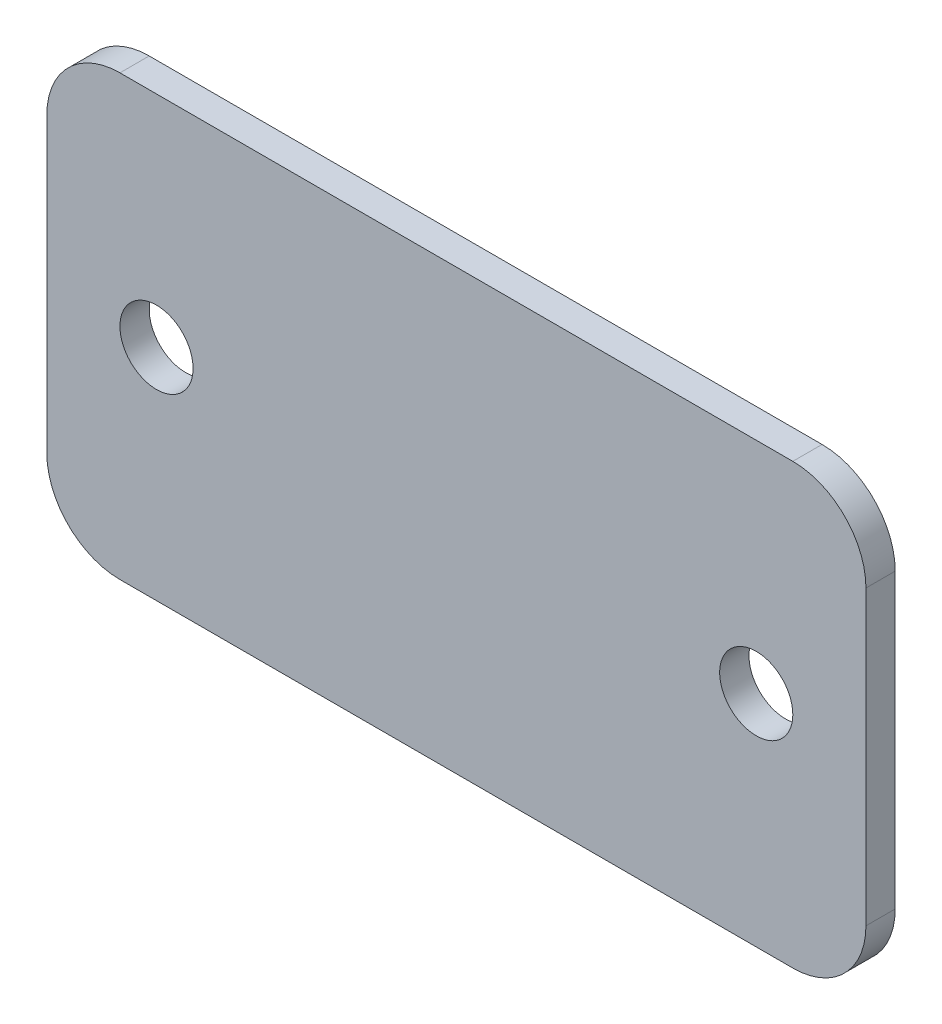
ISO-10303-21;
HEADER;
FILE_DESCRIPTION(('STEP AP214'),'2;1');
FILE_NAME('part.step','',(''),(''),'','','');
FILE_SCHEMA(('AUTOMOTIVE_DESIGN { 1 0 10303 214 1 1 1 1 }'));
ENDSEC;
DATA;
#1=APPLICATION_CONTEXT('core data for automotive mechanical design processes');
#2=APPLICATION_PROTOCOL_DEFINITION('international standard','automotive_design',2000,#1);
#3=PRODUCT_CONTEXT('',#1,'mechanical');
#4=PRODUCT('Part','Part','',(#3));
#5=PRODUCT_RELATED_PRODUCT_CATEGORY('part','',(#4));
#6=PRODUCT_DEFINITION_FORMATION('','',#4);
#7=PRODUCT_DEFINITION_CONTEXT('part definition',#1,'design');
#8=PRODUCT_DEFINITION('design','',#6,#7);
#9=PRODUCT_DEFINITION_SHAPE('','',#8);
#10=(LENGTH_UNIT() NAMED_UNIT(*) SI_UNIT(.MILLI.,.METRE.));
#11=(NAMED_UNIT(*) PLANE_ANGLE_UNIT() SI_UNIT($,.RADIAN.));
#12=(NAMED_UNIT(*) SI_UNIT($,.STERADIAN.) SOLID_ANGLE_UNIT());
#13=UNCERTAINTY_MEASURE_WITH_UNIT(LENGTH_MEASURE(1.E-05),#10,'distance_accuracy_value','');
#14=(GEOMETRIC_REPRESENTATION_CONTEXT(3) GLOBAL_UNCERTAINTY_ASSIGNED_CONTEXT((#13)) GLOBAL_UNIT_ASSIGNED_CONTEXT((#10,
#11,#12)) REPRESENTATION_CONTEXT('',''));
#15=CARTESIAN_POINT('',(0.,0.,0.));
#16=DIRECTION('',(0.,0.,1.));
#17=DIRECTION('',(1.,0.,0.));
#18=AXIS2_PLACEMENT_3D('',#15,#16,#17);
#19=CARTESIAN_POINT('',(-46.,-20.,4.));
#20=DIRECTION('',(0.,0.,-1.));
#21=DIRECTION('',(-1.,0.,0.));
#22=AXIS2_PLACEMENT_3D('',#19,#20,#21);
#23=PLANE('',#22);
#24=CARTESIAN_POINT('',(-46.,-20.,4.));
#25=DIRECTION('',(0.,0.,1.));
#26=DIRECTION('',(-1.,0.,0.));
#27=AXIS2_PLACEMENT_3D('',#24,#25,#26);
#28=CIRCLE('',#27,10.);
#29=CARTESIAN_POINT('',(-56.,-19.9999999999999,4.));
#30=VERTEX_POINT('',#29);
#31=CARTESIAN_POINT('',(-45.9999999999999,-30.,4.));
#32=VERTEX_POINT('',#31);
#33=EDGE_CURVE('E156',#30,#32,#28,.T.);
#34=ORIENTED_EDGE('',*,*,#33,.T.);
#35=DIRECTION('',(1.,0.,0.));
#36=VECTOR('',#35,1.);
#37=CARTESIAN_POINT('',(45.9999999999999,-30.,4.));
#38=LINE('',#37,#36);
#39=CARTESIAN_POINT('',(45.9999999999999,-30.,4.));
#40=VERTEX_POINT('',#39);
#41=EDGE_CURVE('E96',#32,#40,#38,.T.);
#42=ORIENTED_EDGE('',*,*,#41,.T.);
#43=CARTESIAN_POINT('',(46.,-20.,4.));
#44=DIRECTION('',(0.,0.,1.));
#45=DIRECTION('',(1.,0.,0.));
#46=AXIS2_PLACEMENT_3D('',#43,#44,#45);
#47=CIRCLE('',#46,10.);
#48=CARTESIAN_POINT('',(56.,-20.,4.));
#49=VERTEX_POINT('',#48);
#50=EDGE_CURVE('E167',#40,#49,#47,.T.);
#51=ORIENTED_EDGE('',*,*,#50,.T.);
#52=DIRECTION('',(0.,1.,0.));
#53=VECTOR('',#52,1.);
#54=CARTESIAN_POINT('',(56.,-19.9999999999999,4.));
#55=LINE('',#54,#53);
#56=CARTESIAN_POINT('',(56.,19.9999999999999,4.));
#57=VERTEX_POINT('',#56);
#58=EDGE_CURVE('E170',#49,#57,#55,.T.);
#59=ORIENTED_EDGE('',*,*,#58,.T.);
#60=CARTESIAN_POINT('',(46.,20.,4.));
#61=DIRECTION('',(0.,0.,1.));
#62=DIRECTION('',(1.,0.,0.));
#63=AXIS2_PLACEMENT_3D('',#60,#61,#62);
#64=CIRCLE('',#63,10.);
#65=CARTESIAN_POINT('',(45.9999999999999,30.,4.));
#66=VERTEX_POINT('',#65);
#67=EDGE_CURVE('E115',#57,#66,#64,.T.);
#68=ORIENTED_EDGE('',*,*,#67,.T.);
#69=DIRECTION('',(-1.,0.,0.));
#70=VECTOR('',#69,1.);
#71=CARTESIAN_POINT('',(45.9999999999999,30.,4.));
#72=LINE('',#71,#70);
#73=CARTESIAN_POINT('',(-45.9999999999999,30.,4.));
#74=VERTEX_POINT('',#73);
#75=EDGE_CURVE('E109',#66,#74,#72,.T.);
#76=ORIENTED_EDGE('',*,*,#75,.T.);
#77=CARTESIAN_POINT('',(-46.,20.,4.));
#78=DIRECTION('',(0.,0.,1.));
#79=DIRECTION('',(1.,0.,0.));
#80=AXIS2_PLACEMENT_3D('',#77,#78,#79);
#81=CIRCLE('',#80,10.);
#82=CARTESIAN_POINT('',(-56.,19.9999999999999,4.));
#83=VERTEX_POINT('',#82);
#84=EDGE_CURVE('E113',#74,#83,#81,.T.);
#85=ORIENTED_EDGE('',*,*,#84,.T.);
#86=DIRECTION('',(0.,-1.,0.));
#87=VECTOR('',#86,1.);
#88=CARTESIAN_POINT('',(-56.,-19.9999999999999,4.));
#89=LINE('',#88,#87);
#90=EDGE_CURVE('E53',#83,#30,#89,.T.);
#91=ORIENTED_EDGE('',*,*,#90,.T.);
#92=EDGE_LOOP('',(#34,#42,#51,#59,#68,#76,#85,#91));
#93=FACE_BOUND('',#92,.T.);
#94=CARTESIAN_POINT('',(-41.,0.,4.));
#95=DIRECTION('',(0.,0.,1.));
#96=DIRECTION('',(1.,0.,0.));
#97=AXIS2_PLACEMENT_3D('',#94,#95,#96);
#98=CIRCLE('',#97,5.);
#99=CARTESIAN_POINT('',(-36.,0.,4.));
#100=VERTEX_POINT('',#99);
#101=EDGE_CURVE('E144',#100,#100,#98,.T.);
#102=ORIENTED_EDGE('',*,*,#101,.F.);
#103=EDGE_LOOP('',(#102));
#104=FACE_BOUND('',#103,.T.);
#105=CARTESIAN_POINT('',(41.,0.,4.));
#106=DIRECTION('',(0.,0.,1.));
#107=DIRECTION('',(1.,0.,0.));
#108=AXIS2_PLACEMENT_3D('',#105,#106,#107);
#109=CIRCLE('',#108,5.);
#110=CARTESIAN_POINT('',(46.,0.,4.));
#111=VERTEX_POINT('',#110);
#112=EDGE_CURVE('E155',#111,#111,#109,.T.);
#113=ORIENTED_EDGE('',*,*,#112,.F.);
#114=EDGE_LOOP('',(#113));
#115=FACE_BOUND('',#114,.T.);
#116=ADVANCED_FACE('F36',(#93,#104,#115),#23,.F.);
#117=CARTESIAN_POINT('',(-46.,-20.,0.));
#118=DIRECTION('',(0.,0.,-1.));
#119=DIRECTION('',(-1.,0.,0.));
#120=AXIS2_PLACEMENT_3D('',#117,#118,#119);
#121=PLANE('',#120);
#122=CARTESIAN_POINT('',(-41.,0.,0.));
#123=DIRECTION('',(0.,0.,1.));
#124=DIRECTION('',(1.,0.,0.));
#125=AXIS2_PLACEMENT_3D('',#122,#123,#124);
#126=CIRCLE('',#125,5.);
#127=CARTESIAN_POINT('',(-36.,0.,0.));
#128=VERTEX_POINT('',#127);
#129=EDGE_CURVE('E151',#128,#128,#126,.T.);
#130=ORIENTED_EDGE('',*,*,#129,.T.);
#131=EDGE_LOOP('',(#130));
#132=FACE_BOUND('',#131,.T.);
#133=CARTESIAN_POINT('',(-46.,-20.,0.));
#134=DIRECTION('',(0.,0.,1.));
#135=DIRECTION('',(-1.,0.,0.));
#136=AXIS2_PLACEMENT_3D('',#133,#134,#135);
#137=CIRCLE('',#136,10.);
#138=CARTESIAN_POINT('',(-56.,-19.9999999999999,0.));
#139=VERTEX_POINT('',#138);
#140=CARTESIAN_POINT('',(-45.9999999999999,-30.,0.));
#141=VERTEX_POINT('',#140);
#142=EDGE_CURVE('E150',#139,#141,#137,.T.);
#143=ORIENTED_EDGE('',*,*,#142,.F.);
#144=DIRECTION('',(0.,-1.,0.));
#145=VECTOR('',#144,1.);
#146=CARTESIAN_POINT('',(-56.,-19.9999999999999,0.));
#147=LINE('',#146,#145);
#148=CARTESIAN_POINT('',(-56.,19.9999999999999,0.));
#149=VERTEX_POINT('',#148);
#150=EDGE_CURVE('E88',#149,#139,#147,.T.);
#151=ORIENTED_EDGE('',*,*,#150,.F.);
#152=CARTESIAN_POINT('',(-46.,20.,0.));
#153=DIRECTION('',(0.,0.,1.));
#154=DIRECTION('',(1.,0.,0.));
#155=AXIS2_PLACEMENT_3D('',#152,#153,#154);
#156=CIRCLE('',#155,10.);
#157=CARTESIAN_POINT('',(-45.9999999999999,30.,0.));
#158=VERTEX_POINT('',#157);
#159=EDGE_CURVE('E82',#158,#149,#156,.T.);
#160=ORIENTED_EDGE('',*,*,#159,.F.);
#161=DIRECTION('',(-1.,0.,0.));
#162=VECTOR('',#161,1.);
#163=CARTESIAN_POINT('',(45.9999999999999,30.,0.));
#164=LINE('',#163,#162);
#165=CARTESIAN_POINT('',(45.9999999999999,30.,0.));
#166=VERTEX_POINT('',#165);
#167=EDGE_CURVE('E124',#166,#158,#164,.T.);
#168=ORIENTED_EDGE('',*,*,#167,.F.);
#169=CARTESIAN_POINT('',(46.,20.,0.));
#170=DIRECTION('',(0.,0.,1.));
#171=DIRECTION('',(1.,0.,0.));
#172=AXIS2_PLACEMENT_3D('',#169,#170,#171);
#173=CIRCLE('',#172,10.);
#174=CARTESIAN_POINT('',(56.,19.9999999999999,0.));
#175=VERTEX_POINT('',#174);
#176=EDGE_CURVE('E202',#175,#166,#173,.T.);
#177=ORIENTED_EDGE('',*,*,#176,.F.);
#178=DIRECTION('',(0.,1.,0.));
#179=VECTOR('',#178,1.);
#180=CARTESIAN_POINT('',(56.,-19.9999999999999,0.));
#181=LINE('',#180,#179);
#182=CARTESIAN_POINT('',(56.,-20.,0.));
#183=VERTEX_POINT('',#182);
#184=EDGE_CURVE('E197',#183,#175,#181,.T.);
#185=ORIENTED_EDGE('',*,*,#184,.F.);
#186=CARTESIAN_POINT('',(46.,-20.,0.));
#187=DIRECTION('',(0.,0.,1.));
#188=DIRECTION('',(1.,0.,0.));
#189=AXIS2_PLACEMENT_3D('',#186,#187,#188);
#190=CIRCLE('',#189,10.);
#191=CARTESIAN_POINT('',(45.9999999999999,-30.,0.));
#192=VERTEX_POINT('',#191);
#193=EDGE_CURVE('E189',#192,#183,#190,.T.);
#194=ORIENTED_EDGE('',*,*,#193,.F.);
#195=DIRECTION('',(1.,0.,0.));
#196=VECTOR('',#195,1.);
#197=CARTESIAN_POINT('',(45.9999999999999,-30.,0.));
#198=LINE('',#197,#196);
#199=EDGE_CURVE('E182',#141,#192,#198,.T.);
#200=ORIENTED_EDGE('',*,*,#199,.F.);
#201=EDGE_LOOP('',(#143,#151,#160,#168,#177,#185,#194,#200));
#202=FACE_BOUND('',#201,.T.);
#203=CARTESIAN_POINT('',(41.,0.,0.));
#204=DIRECTION('',(0.,0.,1.));
#205=DIRECTION('',(1.,0.,0.));
#206=AXIS2_PLACEMENT_3D('',#203,#204,#205);
#207=CIRCLE('',#206,5.);
#208=CARTESIAN_POINT('',(46.,0.,0.));
#209=VERTEX_POINT('',#208);
#210=EDGE_CURVE('E152',#209,#209,#207,.T.);
#211=ORIENTED_EDGE('',*,*,#210,.T.);
#212=EDGE_LOOP('',(#211));
#213=FACE_BOUND('',#212,.T.);
#214=ADVANCED_FACE('F217',(#132,#202,#213),#121,.T.);
#215=CARTESIAN_POINT('',(-46.,-20.,4.));
#216=DIRECTION('',(0.,0.,-1.));
#217=DIRECTION('',(-1.,0.,0.));
#218=AXIS2_PLACEMENT_3D('',#215,#216,#217);
#219=CYLINDRICAL_SURFACE('',#218,10.);
#220=ORIENTED_EDGE('',*,*,#142,.T.);
#221=DIRECTION('',(0.,0.,-1.));
#222=VECTOR('',#221,1.);
#223=CARTESIAN_POINT('',(-45.9999999999999,-30.,4.));
#224=LINE('',#223,#222);
#225=EDGE_CURVE('E12',#32,#141,#224,.T.);
#226=ORIENTED_EDGE('',*,*,#225,.F.);
#227=ORIENTED_EDGE('',*,*,#33,.F.);
#228=DIRECTION('',(0.,0.,-1.));
#229=VECTOR('',#228,1.);
#230=CARTESIAN_POINT('',(-56.,-19.9999999999999,4.));
#231=LINE('',#230,#229);
#232=EDGE_CURVE('E132',#30,#139,#231,.T.);
#233=ORIENTED_EDGE('',*,*,#232,.T.);
#234=EDGE_LOOP('',(#220,#226,#227,#233));
#235=FACE_BOUND('',#234,.T.);
#236=ADVANCED_FACE('F38',(#235),#219,.T.);
#237=CARTESIAN_POINT('',(45.9999999999999,-30.,4.));
#238=DIRECTION('',(0.,1.,0.));
#239=DIRECTION('',(-1.,0.,0.));
#240=AXIS2_PLACEMENT_3D('',#237,#238,#239);
#241=PLANE('',#240);
#242=ORIENTED_EDGE('',*,*,#199,.T.);
#243=DIRECTION('',(0.,0.,-1.));
#244=VECTOR('',#243,1.);
#245=CARTESIAN_POINT('',(45.9999999999999,-30.,4.));
#246=LINE('',#245,#244);
#247=EDGE_CURVE('E45',#40,#192,#246,.T.);
#248=ORIENTED_EDGE('',*,*,#247,.F.);
#249=ORIENTED_EDGE('',*,*,#41,.F.);
#250=ORIENTED_EDGE('',*,*,#225,.T.);
#251=EDGE_LOOP('',(#242,#248,#249,#250));
#252=FACE_BOUND('',#251,.T.);
#253=ADVANCED_FACE('F181',(#252),#241,.F.);
#254=CARTESIAN_POINT('',(46.,-20.,4.));
#255=DIRECTION('',(0.,0.,-1.));
#256=DIRECTION('',(-1.,0.,0.));
#257=AXIS2_PLACEMENT_3D('',#254,#255,#256);
#258=CYLINDRICAL_SURFACE('',#257,10.);
#259=ORIENTED_EDGE('',*,*,#193,.T.);
#260=DIRECTION('',(0.,0.,-1.));
#261=VECTOR('',#260,1.);
#262=CARTESIAN_POINT('',(56.,-20.,4.));
#263=LINE('',#262,#261);
#264=EDGE_CURVE('E185',#49,#183,#263,.T.);
#265=ORIENTED_EDGE('',*,*,#264,.F.);
#266=ORIENTED_EDGE('',*,*,#50,.F.);
#267=ORIENTED_EDGE('',*,*,#247,.T.);
#268=EDGE_LOOP('',(#259,#265,#266,#267));
#269=FACE_BOUND('',#268,.T.);
#270=ADVANCED_FACE('F186',(#269),#258,.T.);
#271=CARTESIAN_POINT('',(56.,-19.9999999999999,4.));
#272=DIRECTION('',(-1.,0.,0.));
#273=DIRECTION('',(0.,-1.,0.));
#274=AXIS2_PLACEMENT_3D('',#271,#272,#273);
#275=PLANE('',#274);
#276=ORIENTED_EDGE('',*,*,#184,.T.);
#277=DIRECTION('',(0.,0.,-1.));
#278=VECTOR('',#277,1.);
#279=CARTESIAN_POINT('',(56.,19.9999999999999,4.));
#280=LINE('',#279,#278);
#281=EDGE_CURVE('E192',#57,#175,#280,.T.);
#282=ORIENTED_EDGE('',*,*,#281,.F.);
#283=ORIENTED_EDGE('',*,*,#58,.F.);
#284=ORIENTED_EDGE('',*,*,#264,.T.);
#285=EDGE_LOOP('',(#276,#282,#283,#284));
#286=FACE_BOUND('',#285,.T.);
#287=ADVANCED_FACE('F195',(#286),#275,.F.);
#288=CARTESIAN_POINT('',(46.,20.,4.));
#289=DIRECTION('',(0.,0.,-1.));
#290=DIRECTION('',(-1.,0.,0.));
#291=AXIS2_PLACEMENT_3D('',#288,#289,#290);
#292=CYLINDRICAL_SURFACE('',#291,10.);
#293=ORIENTED_EDGE('',*,*,#176,.T.);
#294=DIRECTION('',(0.,0.,-1.));
#295=VECTOR('',#294,1.);
#296=CARTESIAN_POINT('',(45.9999999999999,30.,4.));
#297=LINE('',#296,#295);
#298=EDGE_CURVE('E125',#66,#166,#297,.T.);
#299=ORIENTED_EDGE('',*,*,#298,.F.);
#300=ORIENTED_EDGE('',*,*,#67,.F.);
#301=ORIENTED_EDGE('',*,*,#281,.T.);
#302=EDGE_LOOP('',(#293,#299,#300,#301));
#303=FACE_BOUND('',#302,.T.);
#304=ADVANCED_FACE('F201',(#303),#292,.T.);
#305=CARTESIAN_POINT('',(45.9999999999999,30.,4.));
#306=DIRECTION('',(0.,-1.,0.));
#307=DIRECTION('',(1.,0.,0.));
#308=AXIS2_PLACEMENT_3D('',#305,#306,#307);
#309=PLANE('',#308);
#310=ORIENTED_EDGE('',*,*,#167,.T.);
#311=DIRECTION('',(0.,0.,-1.));
#312=VECTOR('',#311,1.);
#313=CARTESIAN_POINT('',(-45.9999999999999,30.,4.));
#314=LINE('',#313,#312);
#315=EDGE_CURVE('E121',#74,#158,#314,.T.);
#316=ORIENTED_EDGE('',*,*,#315,.F.);
#317=ORIENTED_EDGE('',*,*,#75,.F.);
#318=ORIENTED_EDGE('',*,*,#298,.T.);
#319=EDGE_LOOP('',(#310,#316,#317,#318));
#320=FACE_BOUND('',#319,.T.);
#321=ADVANCED_FACE('F122',(#320),#309,.F.);
#322=CARTESIAN_POINT('',(-46.,20.,4.));
#323=DIRECTION('',(0.,0.,-1.));
#324=DIRECTION('',(-1.,0.,0.));
#325=AXIS2_PLACEMENT_3D('',#322,#323,#324);
#326=CYLINDRICAL_SURFACE('',#325,10.);
#327=ORIENTED_EDGE('',*,*,#159,.T.);
#328=DIRECTION('',(0.,0.,-1.));
#329=VECTOR('',#328,1.);
#330=CARTESIAN_POINT('',(-56.,19.9999999999999,4.));
#331=LINE('',#330,#329);
#332=EDGE_CURVE('E126',#83,#149,#331,.T.);
#333=ORIENTED_EDGE('',*,*,#332,.F.);
#334=ORIENTED_EDGE('',*,*,#84,.F.);
#335=ORIENTED_EDGE('',*,*,#315,.T.);
#336=EDGE_LOOP('',(#327,#333,#334,#335));
#337=FACE_BOUND('',#336,.T.);
#338=ADVANCED_FACE('F128',(#337),#326,.T.);
#339=CARTESIAN_POINT('',(-56.,-19.9999999999999,4.));
#340=DIRECTION('',(1.,0.,0.));
#341=DIRECTION('',(0.,0.,-1.));
#342=AXIS2_PLACEMENT_3D('',#339,#340,#341);
#343=PLANE('',#342);
#344=ORIENTED_EDGE('',*,*,#150,.T.);
#345=ORIENTED_EDGE('',*,*,#232,.F.);
#346=ORIENTED_EDGE('',*,*,#90,.F.);
#347=ORIENTED_EDGE('',*,*,#332,.T.);
#348=EDGE_LOOP('',(#344,#345,#346,#347));
#349=FACE_BOUND('',#348,.T.);
#350=ADVANCED_FACE('F240',(#349),#343,.F.);
#351=CARTESIAN_POINT('',(-41.,0.,4.));
#352=DIRECTION('',(0.,0.,-1.));
#353=DIRECTION('',(-1.,0.,0.));
#354=AXIS2_PLACEMENT_3D('',#351,#352,#353);
#355=CYLINDRICAL_SURFACE('',#354,5.);
#356=ORIENTED_EDGE('',*,*,#101,.T.);
#357=EDGE_LOOP('',(#356));
#358=FACE_BOUND('',#357,.T.);
#359=ORIENTED_EDGE('',*,*,#129,.F.);
#360=EDGE_LOOP('',(#359));
#361=FACE_BOUND('',#360,.T.);
#362=ADVANCED_FACE('F237',(#358,#361),#355,.F.);
#363=CARTESIAN_POINT('',(41.,0.,4.));
#364=DIRECTION('',(0.,0.,-1.));
#365=DIRECTION('',(-1.,0.,0.));
#366=AXIS2_PLACEMENT_3D('',#363,#364,#365);
#367=CYLINDRICAL_SURFACE('',#366,5.);
#368=ORIENTED_EDGE('',*,*,#112,.T.);
#369=EDGE_LOOP('',(#368));
#370=FACE_BOUND('',#369,.T.);
#371=ORIENTED_EDGE('',*,*,#210,.F.);
#372=EDGE_LOOP('',(#371));
#373=FACE_BOUND('',#372,.T.);
#374=ADVANCED_FACE('F230',(#370,#373),#367,.F.);
#375=CLOSED_SHELL('',(#116,#214,#236,#253,#270,#287,#304,#321,#338,#350,#362,#374));
#376=MANIFOLD_SOLID_BREP('B2',#375);
#377=ADVANCED_BREP_SHAPE_REPRESENTATION('',(#18,#376),#14);
#378=SHAPE_DEFINITION_REPRESENTATION(#9,#377);
ENDSEC;
END-ISO-10303-21;
